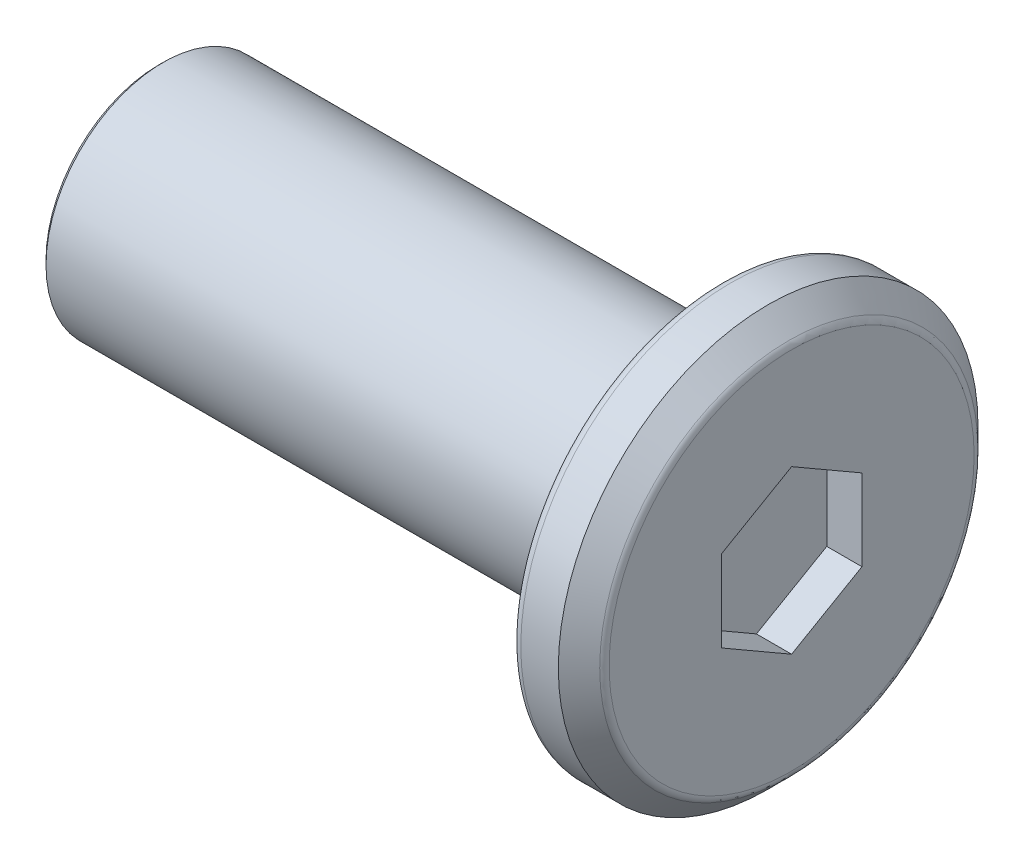
ISO-10303-21;
HEADER;
FILE_DESCRIPTION(('STEP AP214'),'2;1');
FILE_NAME('part.step','',(''),(''),'','','');
FILE_SCHEMA(('AUTOMOTIVE_DESIGN { 1 0 10303 214 1 1 1 1 }'));
ENDSEC;
DATA;
#1=APPLICATION_CONTEXT('core data for automotive mechanical design processes');
#2=APPLICATION_PROTOCOL_DEFINITION('international standard','automotive_design',2000,#1);
#3=PRODUCT_CONTEXT('',#1,'mechanical');
#4=PRODUCT('Part','Part','',(#3));
#5=PRODUCT_RELATED_PRODUCT_CATEGORY('part','',(#4));
#6=PRODUCT_DEFINITION_FORMATION('','',#4);
#7=PRODUCT_DEFINITION_CONTEXT('part definition',#1,'design');
#8=PRODUCT_DEFINITION('design','',#6,#7);
#9=PRODUCT_DEFINITION_SHAPE('','',#8);
#10=(LENGTH_UNIT() NAMED_UNIT(*) SI_UNIT(.MILLI.,.METRE.));
#11=(NAMED_UNIT(*) PLANE_ANGLE_UNIT() SI_UNIT($,.RADIAN.));
#12=(NAMED_UNIT(*) SI_UNIT($,.STERADIAN.) SOLID_ANGLE_UNIT());
#13=UNCERTAINTY_MEASURE_WITH_UNIT(LENGTH_MEASURE(1.E-05),#10,'distance_accuracy_value','');
#14=(GEOMETRIC_REPRESENTATION_CONTEXT(3) GLOBAL_UNCERTAINTY_ASSIGNED_CONTEXT((#13)) GLOBAL_UNIT_ASSIGNED_CONTEXT((#10,
#11,#12)) REPRESENTATION_CONTEXT('',''));
#15=CARTESIAN_POINT('',(0.,0.,0.));
#16=DIRECTION('',(0.,0.,1.));
#17=DIRECTION('',(1.,0.,0.));
#18=AXIS2_PLACEMENT_3D('',#15,#16,#17);
#19=CARTESIAN_POINT('',(0.75,0.,0.));
#20=DIRECTION('',(1.,0.,0.));
#21=DIRECTION('',(0.,0.,-1.));
#22=AXIS2_PLACEMENT_3D('',#19,#20,#21);
#23=PLANE('',#22);
#24=CARTESIAN_POINT('',(0.75,0.,0.));
#25=DIRECTION('',(1.,0.,0.));
#26=DIRECTION('',(0.,0.,-1.));
#27=AXIS2_PLACEMENT_3D('',#24,#25,#26);
#28=CIRCLE('',#27,3.89215728752538);
#29=CARTESIAN_POINT('',(0.75,0.,-3.89215728752538));
#30=VERTEX_POINT('',#29);
#31=EDGE_CURVE('E132',#30,#30,#28,.T.);
#32=ORIENTED_EDGE('',*,*,#31,.T.);
#33=EDGE_LOOP('',(#32));
#34=FACE_BOUND('',#33,.T.);
#35=DIRECTION('',(0.,-1.,0.));
#36=VECTOR('',#35,1.);
#37=CARTESIAN_POINT('',(0.75,0.,-1.5));
#38=LINE('',#37,#36);
#39=CARTESIAN_POINT('',(0.75,0.866025403784438,-1.5));
#40=VERTEX_POINT('',#39);
#41=CARTESIAN_POINT('',(0.75,-0.866025403784439,-1.5));
#42=VERTEX_POINT('',#41);
#43=EDGE_CURVE('E120',#40,#42,#38,.T.);
#44=ORIENTED_EDGE('',*,*,#43,.T.);
#45=DIRECTION('',(0.,-0.5,0.866025403784439));
#46=VECTOR('',#45,1.);
#47=CARTESIAN_POINT('',(0.75,-1.29903810567666,-0.75));
#48=LINE('',#47,#46);
#49=CARTESIAN_POINT('',(0.75,-1.73205080756888,0.));
#50=VERTEX_POINT('',#49);
#51=EDGE_CURVE('E40',#42,#50,#48,.T.);
#52=ORIENTED_EDGE('',*,*,#51,.T.);
#53=DIRECTION('',(0.,0.5,0.866025403784439));
#54=VECTOR('',#53,1.);
#55=CARTESIAN_POINT('',(0.75,-1.29903810567666,0.75));
#56=LINE('',#55,#54);
#57=CARTESIAN_POINT('',(0.75,-0.866025403784438,1.5));
#58=VERTEX_POINT('',#57);
#59=EDGE_CURVE('E76',#50,#58,#56,.T.);
#60=ORIENTED_EDGE('',*,*,#59,.T.);
#61=DIRECTION('',(0.,1.,0.));
#62=VECTOR('',#61,1.);
#63=CARTESIAN_POINT('',(0.75,0.,1.5));
#64=LINE('',#63,#62);
#65=CARTESIAN_POINT('',(0.75,0.866025403784439,1.5));
#66=VERTEX_POINT('',#65);
#67=EDGE_CURVE('E111',#58,#66,#64,.T.);
#68=ORIENTED_EDGE('',*,*,#67,.T.);
#69=DIRECTION('',(0.,0.5,-0.866025403784439));
#70=VECTOR('',#69,1.);
#71=CARTESIAN_POINT('',(0.75,1.29903810567666,0.75));
#72=LINE('',#71,#70);
#73=CARTESIAN_POINT('',(0.75,1.73205080756888,0.));
#74=VERTEX_POINT('',#73);
#75=EDGE_CURVE('E114',#66,#74,#72,.T.);
#76=ORIENTED_EDGE('',*,*,#75,.T.);
#77=DIRECTION('',(0.,-0.5,-0.866025403784439));
#78=VECTOR('',#77,1.);
#79=CARTESIAN_POINT('',(0.75,1.29903810567666,-0.75));
#80=LINE('',#79,#78);
#81=EDGE_CURVE('E117',#74,#40,#80,.T.);
#82=ORIENTED_EDGE('',*,*,#81,.T.);
#83=EDGE_LOOP('',(#44,#52,#60,#68,#76,#82));
#84=FACE_BOUND('',#83,.T.);
#85=ADVANCED_FACE('F16',(#34,#84),#23,.T.);
#86=CARTESIAN_POINT('',(-0.75,0.,0.));
#87=DIRECTION('',(1.,0.,0.));
#88=DIRECTION('',(0.,0.,-1.));
#89=AXIS2_PLACEMENT_3D('',#86,#87,#88);
#90=PLANE('',#89);
#91=CARTESIAN_POINT('',(-0.75,0.,0.));
#92=DIRECTION('',(1.,0.,0.));
#93=DIRECTION('',(0.,0.,-1.));
#94=AXIS2_PLACEMENT_3D('',#91,#92,#93);
#95=CIRCLE('',#94,4.275);
#96=CARTESIAN_POINT('',(-0.75,0.,-4.275));
#97=VERTEX_POINT('',#96);
#98=EDGE_CURVE('E141',#97,#97,#95,.F.);
#99=ORIENTED_EDGE('',*,*,#98,.T.);
#100=EDGE_LOOP('',(#99));
#101=FACE_BOUND('',#100,.T.);
#102=CARTESIAN_POINT('',(-0.75,0.,0.));
#103=DIRECTION('',(1.,0.,0.));
#104=DIRECTION('',(0.,0.,-1.));
#105=AXIS2_PLACEMENT_3D('',#102,#103,#104);
#106=CIRCLE('',#105,2.75);
#107=CARTESIAN_POINT('',(-0.75,0.,-2.75));
#108=VERTEX_POINT('',#107);
#109=EDGE_CURVE('E129',#108,#108,#106,.T.);
#110=ORIENTED_EDGE('',*,*,#109,.T.);
#111=EDGE_LOOP('',(#110));
#112=FACE_BOUND('',#111,.T.);
#113=ADVANCED_FACE('F159',(#101,#112),#90,.F.);
#114=CARTESIAN_POINT('',(0.75,0.,0.));
#115=DIRECTION('',(-1.,0.,0.));
#116=DIRECTION('',(0.,0.,1.));
#117=AXIS2_PLACEMENT_3D('',#114,#115,#116);
#118=CYLINDRICAL_SURFACE('',#117,4.475);
#119=CARTESIAN_POINT('',(-0.55,0.,0.));
#120=DIRECTION('',(1.,0.,0.));
#121=DIRECTION('',(0.,0.,-1.));
#122=AXIS2_PLACEMENT_3D('',#119,#120,#121);
#123=CIRCLE('',#122,4.475);
#124=CARTESIAN_POINT('',(-0.55,0.,-4.475));
#125=VERTEX_POINT('',#124);
#126=EDGE_CURVE('E138',#125,#125,#123,.T.);
#127=ORIENTED_EDGE('',*,*,#126,.T.);
#128=EDGE_LOOP('',(#127));
#129=FACE_BOUND('',#128,.T.);
#130=CARTESIAN_POINT('',(0.249999999999999,0.,0.));
#131=DIRECTION('',(1.,0.,0.));
#132=DIRECTION('',(0.,0.,-1.));
#133=AXIS2_PLACEMENT_3D('',#130,#131,#132);
#134=CIRCLE('',#133,4.475);
#135=CARTESIAN_POINT('',(0.249999999999999,0.,-4.475));
#136=VERTEX_POINT('',#135);
#137=EDGE_CURVE('E123',#136,#136,#134,.F.);
#138=ORIENTED_EDGE('',*,*,#137,.T.);
#139=EDGE_LOOP('',(#138));
#140=FACE_BOUND('',#139,.T.);
#141=ADVANCED_FACE('F165',(#129,#140),#118,.T.);
#142=CARTESIAN_POINT('',(-12.75,0.,0.));
#143=DIRECTION('',(1.,0.,0.));
#144=DIRECTION('',(0.,0.,-1.));
#145=AXIS2_PLACEMENT_3D('',#142,#143,#144);
#146=CYLINDRICAL_SURFACE('',#145,2.5);
#147=CARTESIAN_POINT('',(-12.65,0.,0.));
#148=DIRECTION('',(-1.,0.,0.));
#149=DIRECTION('',(0.,0.,1.));
#150=AXIS2_PLACEMENT_3D('',#147,#148,#149);
#151=CIRCLE('',#150,2.5);
#152=CARTESIAN_POINT('',(-12.65,0.,2.5));
#153=VERTEX_POINT('',#152);
#154=EDGE_CURVE('E10',#153,#153,#151,.F.);
#155=ORIENTED_EDGE('',*,*,#154,.T.);
#156=EDGE_LOOP('',(#155));
#157=FACE_BOUND('',#156,.T.);
#158=CARTESIAN_POINT('',(-1.,0.,0.));
#159=DIRECTION('',(1.,0.,0.));
#160=DIRECTION('',(0.,0.,-1.));
#161=AXIS2_PLACEMENT_3D('',#158,#159,#160);
#162=CIRCLE('',#161,2.5);
#163=CARTESIAN_POINT('',(-1.,0.,-2.5));
#164=VERTEX_POINT('',#163);
#165=EDGE_CURVE('E126',#164,#164,#162,.F.);
#166=ORIENTED_EDGE('',*,*,#165,.T.);
#167=EDGE_LOOP('',(#166));
#168=FACE_BOUND('',#167,.T.);
#169=ADVANCED_FACE('F170',(#157,#168),#146,.T.);
#170=CARTESIAN_POINT('',(-12.75,0.,0.));
#171=DIRECTION('',(-1.,0.,0.));
#172=DIRECTION('',(0.,0.,1.));
#173=AXIS2_PLACEMENT_3D('',#170,#171,#172);
#174=PLANE('',#173);
#175=CARTESIAN_POINT('',(-12.75,0.,0.));
#176=DIRECTION('',(-1.,0.,0.));
#177=DIRECTION('',(0.,0.,1.));
#178=AXIS2_PLACEMENT_3D('',#175,#176,#177);
#179=CIRCLE('',#178,2.4);
#180=CARTESIAN_POINT('',(-12.75,0.,2.4));
#181=VERTEX_POINT('',#180);
#182=EDGE_CURVE('E25',#181,#181,#179,.T.);
#183=ORIENTED_EDGE('',*,*,#182,.T.);
#184=EDGE_LOOP('',(#183));
#185=FACE_BOUND('',#184,.T.);
#186=ADVANCED_FACE('F146',(#185),#174,.T.);
#187=CARTESIAN_POINT('',(2.,-1.73205080756888,0.));
#188=DIRECTION('',(0.,0.866025403784439,0.5));
#189=DIRECTION('',(0.,-0.5,0.866025403784439));
#190=AXIS2_PLACEMENT_3D('',#187,#188,#189);
#191=PLANE('',#190);
#192=DIRECTION('',(-1.,0.,0.));
#193=VECTOR('',#192,1.);
#194=CARTESIAN_POINT('',(2.,-0.866025403784439,-1.5));
#195=LINE('',#194,#193);
#196=CARTESIAN_POINT('',(0.,-0.866025403784439,-1.5));
#197=VERTEX_POINT('',#196);
#198=EDGE_CURVE('E69',#42,#197,#195,.T.);
#199=ORIENTED_EDGE('',*,*,#198,.T.);
#200=DIRECTION('',(0.,0.5,-0.866025403784439));
#201=VECTOR('',#200,1.);
#202=CARTESIAN_POINT('',(0.,-1.73205080756888,0.));
#203=LINE('',#202,#201);
#204=CARTESIAN_POINT('',(0.,-1.73205080756888,0.));
#205=VERTEX_POINT('',#204);
#206=EDGE_CURVE('E73',#205,#197,#203,.T.);
#207=ORIENTED_EDGE('',*,*,#206,.F.);
#208=DIRECTION('',(-1.,0.,0.));
#209=VECTOR('',#208,1.);
#210=CARTESIAN_POINT('',(2.,-1.73205080756888,0.));
#211=LINE('',#210,#209);
#212=EDGE_CURVE('E101',#50,#205,#211,.T.);
#213=ORIENTED_EDGE('',*,*,#212,.F.);
#214=ORIENTED_EDGE('',*,*,#51,.F.);
#215=EDGE_LOOP('',(#199,#207,#213,#214));
#216=FACE_BOUND('',#215,.T.);
#217=ADVANCED_FACE('F71',(#216),#191,.T.);
#218=CARTESIAN_POINT('',(2.,-0.866025403784439,-1.5));
#219=DIRECTION('',(0.,0.,1.));
#220=DIRECTION('',(1.,0.,0.));
#221=AXIS2_PLACEMENT_3D('',#218,#219,#220);
#222=PLANE('',#221);
#223=DIRECTION('',(-1.,0.,0.));
#224=VECTOR('',#223,1.);
#225=CARTESIAN_POINT('',(2.,0.866025403784438,-1.5));
#226=LINE('',#225,#224);
#227=CARTESIAN_POINT('',(0.,0.866025403784438,-1.5));
#228=VERTEX_POINT('',#227);
#229=EDGE_CURVE('E77',#40,#228,#226,.T.);
#230=ORIENTED_EDGE('',*,*,#229,.T.);
#231=DIRECTION('',(0.,1.,0.));
#232=VECTOR('',#231,1.);
#233=CARTESIAN_POINT('',(0.,-0.866025403784439,-1.5));
#234=LINE('',#233,#232);
#235=EDGE_CURVE('E80',#197,#228,#234,.T.);
#236=ORIENTED_EDGE('',*,*,#235,.F.);
#237=ORIENTED_EDGE('',*,*,#198,.F.);
#238=ORIENTED_EDGE('',*,*,#43,.F.);
#239=EDGE_LOOP('',(#230,#236,#237,#238));
#240=FACE_BOUND('',#239,.T.);
#241=ADVANCED_FACE('F81',(#240),#222,.T.);
#242=CARTESIAN_POINT('',(2.,0.866025403784438,-1.5));
#243=DIRECTION('',(0.,-0.866025403784439,0.5));
#244=DIRECTION('',(0.,-0.5,-0.866025403784439));
#245=AXIS2_PLACEMENT_3D('',#242,#243,#244);
#246=PLANE('',#245);
#247=DIRECTION('',(-1.,0.,0.));
#248=VECTOR('',#247,1.);
#249=CARTESIAN_POINT('',(2.,1.73205080756888,0.));
#250=LINE('',#249,#248);
#251=CARTESIAN_POINT('',(0.,1.73205080756888,0.));
#252=VERTEX_POINT('',#251);
#253=EDGE_CURVE('E106',#74,#252,#250,.T.);
#254=ORIENTED_EDGE('',*,*,#253,.T.);
#255=DIRECTION('',(0.,0.5,0.866025403784438));
#256=VECTOR('',#255,1.);
#257=CARTESIAN_POINT('',(0.,0.866025403784438,-1.5));
#258=LINE('',#257,#256);
#259=EDGE_CURVE('E86',#228,#252,#258,.T.);
#260=ORIENTED_EDGE('',*,*,#259,.F.);
#261=ORIENTED_EDGE('',*,*,#229,.F.);
#262=ORIENTED_EDGE('',*,*,#81,.F.);
#263=EDGE_LOOP('',(#254,#260,#261,#262));
#264=FACE_BOUND('',#263,.T.);
#265=ADVANCED_FACE('F288',(#264),#246,.T.);
#266=CARTESIAN_POINT('',(2.,1.73205080756888,0.));
#267=DIRECTION('',(0.,-0.866025403784439,-0.5));
#268=DIRECTION('',(0.,0.5,-0.866025403784439));
#269=AXIS2_PLACEMENT_3D('',#266,#267,#268);
#270=PLANE('',#269);
#271=DIRECTION('',(-1.,0.,0.));
#272=VECTOR('',#271,1.);
#273=CARTESIAN_POINT('',(2.,0.866025403784439,1.5));
#274=LINE('',#273,#272);
#275=CARTESIAN_POINT('',(0.,0.866025403784439,1.5));
#276=VERTEX_POINT('',#275);
#277=EDGE_CURVE('E104',#66,#276,#274,.T.);
#278=ORIENTED_EDGE('',*,*,#277,.T.);
#279=DIRECTION('',(0.,-0.5,0.866025403784439));
#280=VECTOR('',#279,1.);
#281=CARTESIAN_POINT('',(0.,1.73205080756888,0.));
#282=LINE('',#281,#280);
#283=EDGE_CURVE('E95',#252,#276,#282,.T.);
#284=ORIENTED_EDGE('',*,*,#283,.F.);
#285=ORIENTED_EDGE('',*,*,#253,.F.);
#286=ORIENTED_EDGE('',*,*,#75,.F.);
#287=EDGE_LOOP('',(#278,#284,#285,#286));
#288=FACE_BOUND('',#287,.T.);
#289=ADVANCED_FACE('F279',(#288),#270,.T.);
#290=CARTESIAN_POINT('',(2.,0.866025403784439,1.5));
#291=DIRECTION('',(0.,0.,-1.));
#292=DIRECTION('',(-1.,0.,0.));
#293=AXIS2_PLACEMENT_3D('',#290,#291,#292);
#294=PLANE('',#293);
#295=DIRECTION('',(-1.,0.,0.));
#296=VECTOR('',#295,1.);
#297=CARTESIAN_POINT('',(2.,-0.866025403784438,1.5));
#298=LINE('',#297,#296);
#299=CARTESIAN_POINT('',(0.,-0.866025403784438,1.5));
#300=VERTEX_POINT('',#299);
#301=EDGE_CURVE('E32',#58,#300,#298,.T.);
#302=ORIENTED_EDGE('',*,*,#301,.T.);
#303=DIRECTION('',(0.,-1.,0.));
#304=VECTOR('',#303,1.);
#305=CARTESIAN_POINT('',(0.,0.866025403784439,1.5));
#306=LINE('',#305,#304);
#307=EDGE_CURVE('E98',#276,#300,#306,.T.);
#308=ORIENTED_EDGE('',*,*,#307,.F.);
#309=ORIENTED_EDGE('',*,*,#277,.F.);
#310=ORIENTED_EDGE('',*,*,#67,.F.);
#311=EDGE_LOOP('',(#302,#308,#309,#310));
#312=FACE_BOUND('',#311,.T.);
#313=ADVANCED_FACE('F271',(#312),#294,.T.);
#314=CARTESIAN_POINT('',(2.,-0.866025403784438,1.5));
#315=DIRECTION('',(0.,0.866025403784438,-0.5));
#316=DIRECTION('',(0.,0.5,0.866025403784439));
#317=AXIS2_PLACEMENT_3D('',#314,#315,#316);
#318=PLANE('',#317);
#319=ORIENTED_EDGE('',*,*,#212,.T.);
#320=DIRECTION('',(0.,-0.5,-0.866025403784438));
#321=VECTOR('',#320,1.);
#322=CARTESIAN_POINT('',(0.,-0.866025403784438,1.5));
#323=LINE('',#322,#321);
#324=EDGE_CURVE('E91',#300,#205,#323,.T.);
#325=ORIENTED_EDGE('',*,*,#324,.F.);
#326=ORIENTED_EDGE('',*,*,#301,.F.);
#327=ORIENTED_EDGE('',*,*,#59,.F.);
#328=EDGE_LOOP('',(#319,#325,#326,#327));
#329=FACE_BOUND('',#328,.T.);
#330=ADVANCED_FACE('F263',(#329),#318,.T.);
#331=CARTESIAN_POINT('',(0.,0.,0.));
#332=DIRECTION('',(1.,0.,0.));
#333=DIRECTION('',(0.,0.,-1.));
#334=AXIS2_PLACEMENT_3D('',#331,#332,#333);
#335=PLANE('',#334);
#336=ORIENTED_EDGE('',*,*,#206,.T.);
#337=ORIENTED_EDGE('',*,*,#235,.T.);
#338=ORIENTED_EDGE('',*,*,#259,.T.);
#339=ORIENTED_EDGE('',*,*,#283,.T.);
#340=ORIENTED_EDGE('',*,*,#307,.T.);
#341=ORIENTED_EDGE('',*,*,#324,.T.);
#342=EDGE_LOOP('',(#336,#337,#338,#339,#340,#341));
#343=FACE_BOUND('',#342,.T.);
#344=ADVANCED_FACE('F89',(#343),#335,.T.);
#345=CARTESIAN_POINT('',(0.75,0.,0.));
#346=DIRECTION('',(-1.,0.,0.));
#347=DIRECTION('',(0.,0.,1.));
#348=AXIS2_PLACEMENT_3D('',#345,#346,#347);
#349=CONICAL_SURFACE('',#348,3.975,0.785398163397449);
#350=CARTESIAN_POINT('',(0.691421356237309,0.,0.));
#351=DIRECTION('',(1.,0.,0.));
#352=DIRECTION('',(0.,0.,-1.));
#353=AXIS2_PLACEMENT_3D('',#350,#351,#352);
#354=CIRCLE('',#353,4.03357864376269);
#355=CARTESIAN_POINT('',(0.691421356237309,0.,-4.03357864376269));
#356=VERTEX_POINT('',#355);
#357=EDGE_CURVE('E135',#356,#356,#354,.F.);
#358=ORIENTED_EDGE('',*,*,#357,.T.);
#359=EDGE_LOOP('',(#358));
#360=FACE_BOUND('',#359,.T.);
#361=ORIENTED_EDGE('',*,*,#137,.F.);
#362=EDGE_LOOP('',(#361));
#363=FACE_BOUND('',#362,.T.);
#364=ADVANCED_FACE('F176',(#360,#363),#349,.T.);
#365=CARTESIAN_POINT('',(-1.,0.,0.));
#366=DIRECTION('',(1.,0.,0.));
#367=DIRECTION('',(0.,0.,-1.));
#368=AXIS2_PLACEMENT_3D('',#365,#366,#367);
#369=TOROIDAL_SURFACE('',#368,2.75,0.25);
#370=ORIENTED_EDGE('',*,*,#109,.F.);
#371=EDGE_LOOP('',(#370));
#372=FACE_BOUND('',#371,.T.);
#373=ORIENTED_EDGE('',*,*,#165,.F.);
#374=EDGE_LOOP('',(#373));
#375=FACE_BOUND('',#374,.T.);
#376=ADVANCED_FACE('F179',(#372,#375),#369,.F.);
#377=CARTESIAN_POINT('',(0.55,0.,0.));
#378=DIRECTION('',(1.,0.,0.));
#379=DIRECTION('',(0.,0.,-1.));
#380=AXIS2_PLACEMENT_3D('',#377,#378,#379);
#381=TOROIDAL_SURFACE('',#380,3.89215728752538,0.2);
#382=ORIENTED_EDGE('',*,*,#357,.F.);
#383=EDGE_LOOP('',(#382));
#384=FACE_BOUND('',#383,.T.);
#385=ORIENTED_EDGE('',*,*,#31,.F.);
#386=EDGE_LOOP('',(#385));
#387=FACE_BOUND('',#386,.T.);
#388=ADVANCED_FACE('F155',(#384,#387),#381,.T.);
#389=CARTESIAN_POINT('',(-0.55,0.,0.));
#390=DIRECTION('',(1.,0.,0.));
#391=DIRECTION('',(0.,0.,-1.));
#392=AXIS2_PLACEMENT_3D('',#389,#390,#391);
#393=TOROIDAL_SURFACE('',#392,4.275,0.2);
#394=ORIENTED_EDGE('',*,*,#98,.F.);
#395=EDGE_LOOP('',(#394));
#396=FACE_BOUND('',#395,.T.);
#397=ORIENTED_EDGE('',*,*,#126,.F.);
#398=EDGE_LOOP('',(#397));
#399=FACE_BOUND('',#398,.T.);
#400=ADVANCED_FACE('F149',(#396,#399),#393,.T.);
#401=CARTESIAN_POINT('',(-12.75,0.,0.));
#402=DIRECTION('',(1.,0.,0.));
#403=DIRECTION('',(0.,0.,-1.));
#404=AXIS2_PLACEMENT_3D('',#401,#402,#403);
#405=CONICAL_SURFACE('',#404,2.4,0.785398163397455);
#406=ORIENTED_EDGE('',*,*,#154,.F.);
#407=EDGE_LOOP('',(#406));
#408=FACE_BOUND('',#407,.T.);
#409=ORIENTED_EDGE('',*,*,#182,.F.);
#410=EDGE_LOOP('',(#409));
#411=FACE_BOUND('',#410,.T.);
#412=ADVANCED_FACE('F19',(#408,#411),#405,.T.);
#413=CLOSED_SHELL('',(#85,#113,#141,#169,#186,#217,#241,#265,#289,#313,#330,#344,#364,#376,#388,
#400,#412));
#414=MANIFOLD_SOLID_BREP('B1',#413);
#415=ADVANCED_BREP_SHAPE_REPRESENTATION('',(#18,#414),#14);
#416=SHAPE_DEFINITION_REPRESENTATION(#9,#415);
ENDSEC;
END-ISO-10303-21;
